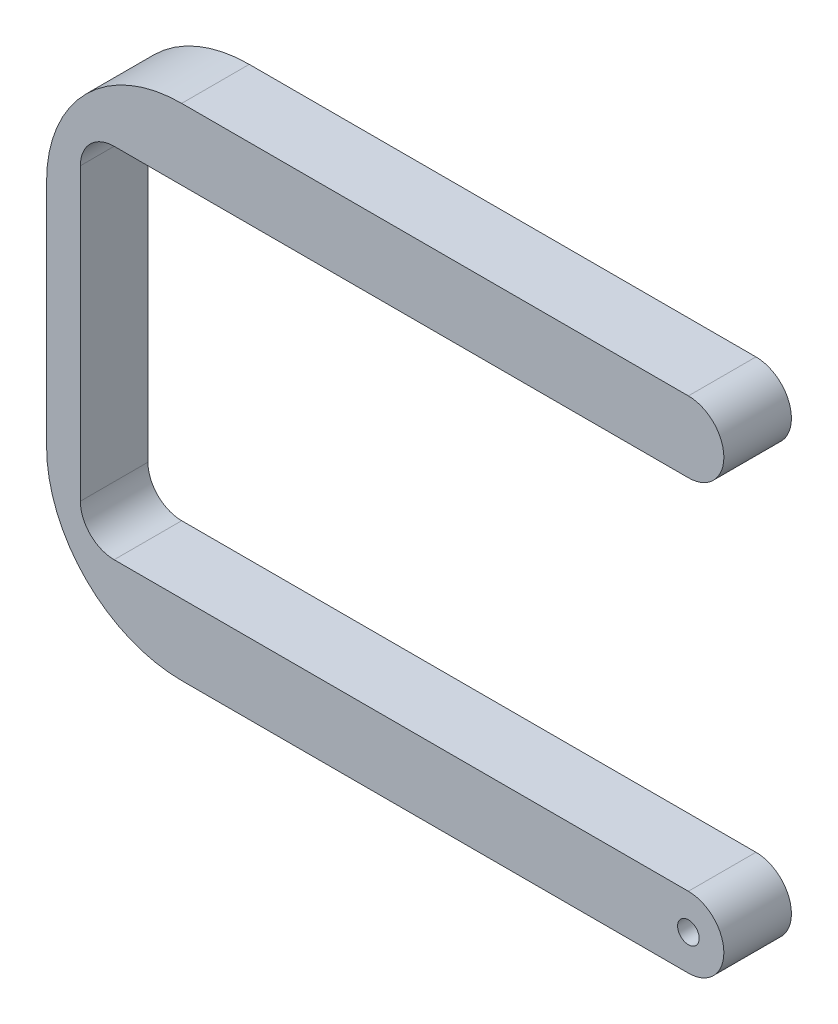
ISO-10303-21;
HEADER;
FILE_DESCRIPTION(('STEP AP214'),'2;1');
FILE_NAME('part.step','',(''),(''),'','','');
FILE_SCHEMA(('AUTOMOTIVE_DESIGN { 1 0 10303 214 1 1 1 1 }'));
ENDSEC;
DATA;
#1=APPLICATION_CONTEXT('core data for automotive mechanical design processes');
#2=APPLICATION_PROTOCOL_DEFINITION('international standard','automotive_design',2000,#1);
#3=PRODUCT_CONTEXT('',#1,'mechanical');
#4=PRODUCT('Part','Part','',(#3));
#5=PRODUCT_RELATED_PRODUCT_CATEGORY('part','',(#4));
#6=PRODUCT_DEFINITION_FORMATION('','',#4);
#7=PRODUCT_DEFINITION_CONTEXT('part definition',#1,'design');
#8=PRODUCT_DEFINITION('design','',#6,#7);
#9=PRODUCT_DEFINITION_SHAPE('','',#8);
#10=(LENGTH_UNIT() NAMED_UNIT(*) SI_UNIT(.MILLI.,.METRE.));
#11=(NAMED_UNIT(*) PLANE_ANGLE_UNIT() SI_UNIT($,.RADIAN.));
#12=(NAMED_UNIT(*) SI_UNIT($,.STERADIAN.) SOLID_ANGLE_UNIT());
#13=UNCERTAINTY_MEASURE_WITH_UNIT(LENGTH_MEASURE(1.E-05),#10,'distance_accuracy_value','');
#14=(GEOMETRIC_REPRESENTATION_CONTEXT(3) GLOBAL_UNCERTAINTY_ASSIGNED_CONTEXT((#13)) GLOBAL_UNIT_ASSIGNED_CONTEXT((#10,
#11,#12)) REPRESENTATION_CONTEXT('',''));
#15=CARTESIAN_POINT('',(0.,0.,0.));
#16=DIRECTION('',(0.,0.,1.));
#17=DIRECTION('',(1.,0.,0.));
#18=AXIS2_PLACEMENT_3D('',#15,#16,#17);
#19=CARTESIAN_POINT('',(-143.092977135482,0.,10.));
#20=DIRECTION('',(1.,0.,0.));
#21=DIRECTION('',(0.,0.,-1.));
#22=AXIS2_PLACEMENT_3D('',#19,#20,#21);
#23=PLANE('',#22);
#24=DIRECTION('',(0.,-1.,0.));
#25=VECTOR('',#24,1.);
#26=CARTESIAN_POINT('',(-143.092977135482,0.,0.));
#27=LINE('',#26,#25);
#28=CARTESIAN_POINT('',(-143.092977135482,-153.645932850951,0.));
#29=VERTEX_POINT('',#28);
#30=CARTESIAN_POINT('',(-143.092977135482,-187.645932850951,0.));
#31=VERTEX_POINT('',#30);
#32=EDGE_CURVE('E158',#29,#31,#27,.T.);
#33=ORIENTED_EDGE('',*,*,#32,.T.);
#34=DIRECTION('',(0.,0.,-1.));
#35=VECTOR('',#34,1.);
#36=CARTESIAN_POINT('',(-143.092977135482,-187.645932850951,10.));
#37=LINE('',#36,#35);
#38=CARTESIAN_POINT('',(-143.092977135482,-187.645932850951,10.));
#39=VERTEX_POINT('',#38);
#40=EDGE_CURVE('E11',#39,#31,#37,.T.);
#41=ORIENTED_EDGE('',*,*,#40,.F.);
#42=DIRECTION('',(0.,-1.,0.));
#43=VECTOR('',#42,1.);
#44=CARTESIAN_POINT('',(-143.092977135482,0.,10.));
#45=LINE('',#44,#43);
#46=CARTESIAN_POINT('',(-143.092977135482,-153.645932850951,10.));
#47=VERTEX_POINT('',#46);
#48=EDGE_CURVE('E188',#47,#39,#45,.T.);
#49=ORIENTED_EDGE('',*,*,#48,.F.);
#50=DIRECTION('',(0.,0.,-1.));
#51=VECTOR('',#50,1.);
#52=CARTESIAN_POINT('',(-143.092977135482,-153.645932850951,10.));
#53=LINE('',#52,#51);
#54=EDGE_CURVE('E157',#47,#29,#53,.T.);
#55=ORIENTED_EDGE('',*,*,#54,.T.);
#56=EDGE_LOOP('',(#33,#41,#49,#55));
#57=FACE_BOUND('',#56,.T.);
#58=ADVANCED_FACE('F36',(#57),#23,.F.);
#59=CARTESIAN_POINT('',(-123.092977135482,-187.645932850951,10.));
#60=DIRECTION('',(0.,0.,-1.));
#61=DIRECTION('',(-1.,0.,0.));
#62=AXIS2_PLACEMENT_3D('',#59,#60,#61);
#63=CYLINDRICAL_SURFACE('',#62,20.);
#64=CARTESIAN_POINT('',(-123.092977135482,-187.645932850951,0.));
#65=DIRECTION('',(0.,0.,1.));
#66=DIRECTION('',(1.,0.,0.));
#67=AXIS2_PLACEMENT_3D('',#64,#65,#66);
#68=CIRCLE('',#67,20.);
#69=CARTESIAN_POINT('',(-123.092977135481,-207.645932850951,0.));
#70=VERTEX_POINT('',#69);
#71=EDGE_CURVE('E161',#31,#70,#68,.T.);
#72=ORIENTED_EDGE('',*,*,#71,.T.);
#73=DIRECTION('',(0.,0.,-1.));
#74=VECTOR('',#73,1.);
#75=CARTESIAN_POINT('',(-123.092977135481,-207.645932850951,10.));
#76=LINE('',#75,#74);
#77=CARTESIAN_POINT('',(-123.092977135481,-207.645932850951,10.));
#78=VERTEX_POINT('',#77);
#79=EDGE_CURVE('E44',#78,#70,#76,.T.);
#80=ORIENTED_EDGE('',*,*,#79,.F.);
#81=CARTESIAN_POINT('',(-123.092977135482,-187.645932850951,10.));
#82=DIRECTION('',(0.,0.,1.));
#83=DIRECTION('',(1.,0.,0.));
#84=AXIS2_PLACEMENT_3D('',#81,#82,#83);
#85=CIRCLE('',#84,20.);
#86=EDGE_CURVE('E106',#39,#78,#85,.T.);
#87=ORIENTED_EDGE('',*,*,#86,.F.);
#88=ORIENTED_EDGE('',*,*,#40,.T.);
#89=EDGE_LOOP('',(#72,#80,#87,#88));
#90=FACE_BOUND('',#89,.T.);
#91=ADVANCED_FACE('F258',(#90),#63,.T.);
#92=CARTESIAN_POINT('',(0.,-207.645932850951,10.));
#93=DIRECTION('',(0.,1.,0.));
#94=DIRECTION('',(0.,0.,1.));
#95=AXIS2_PLACEMENT_3D('',#92,#93,#94);
#96=PLANE('',#95);
#97=DIRECTION('',(1.,0.,0.));
#98=VECTOR('',#97,1.);
#99=CARTESIAN_POINT('',(0.,-207.645932850951,0.));
#100=LINE('',#99,#98);
#101=CARTESIAN_POINT('',(-48.0929771354812,-207.645932850951,0.));
#102=VERTEX_POINT('',#101);
#103=EDGE_CURVE('E164',#70,#102,#100,.T.);
#104=ORIENTED_EDGE('',*,*,#103,.T.);
#105=DIRECTION('',(0.,0.,-1.));
#106=VECTOR('',#105,1.);
#107=CARTESIAN_POINT('',(-48.0929771354812,-207.645932850951,10.));
#108=LINE('',#107,#106);
#109=CARTESIAN_POINT('',(-48.0929771354812,-207.645932850951,10.));
#110=VERTEX_POINT('',#109);
#111=EDGE_CURVE('E202',#110,#102,#108,.T.);
#112=ORIENTED_EDGE('',*,*,#111,.F.);
#113=DIRECTION('',(1.,0.,0.));
#114=VECTOR('',#113,1.);
#115=CARTESIAN_POINT('',(0.,-207.645932850951,10.));
#116=LINE('',#115,#114);
#117=EDGE_CURVE('E209',#78,#110,#116,.T.);
#118=ORIENTED_EDGE('',*,*,#117,.F.);
#119=ORIENTED_EDGE('',*,*,#79,.T.);
#120=EDGE_LOOP('',(#104,#112,#118,#119));
#121=FACE_BOUND('',#120,.T.);
#122=ADVANCED_FACE('F207',(#121),#96,.F.);
#123=CARTESIAN_POINT('',(-48.0929771354814,-202.395932850951,10.));
#124=DIRECTION('',(0.,0.,-1.));
#125=DIRECTION('',(-1.,0.,0.));
#126=AXIS2_PLACEMENT_3D('',#123,#124,#125);
#127=CYLINDRICAL_SURFACE('',#126,5.25);
#128=CARTESIAN_POINT('',(-48.0929771354814,-202.395932850951,0.));
#129=DIRECTION('',(0.,0.,1.));
#130=DIRECTION('',(1.,0.,0.));
#131=AXIS2_PLACEMENT_3D('',#128,#129,#130);
#132=CIRCLE('',#131,5.25);
#133=CARTESIAN_POINT('',(-48.0929771354816,-197.145932850951,0.));
#134=VERTEX_POINT('',#133);
#135=EDGE_CURVE('E167',#134,#102,#132,.F.);
#136=ORIENTED_EDGE('',*,*,#135,.F.);
#137=DIRECTION('',(0.,0.,-1.));
#138=VECTOR('',#137,1.);
#139=CARTESIAN_POINT('',(-48.0929771354816,-197.145932850951,10.));
#140=LINE('',#139,#138);
#141=CARTESIAN_POINT('',(-48.0929771354816,-197.145932850951,10.));
#142=VERTEX_POINT('',#141);
#143=EDGE_CURVE('E200',#142,#134,#140,.T.);
#144=ORIENTED_EDGE('',*,*,#143,.F.);
#145=CARTESIAN_POINT('',(-48.0929771354814,-202.395932850951,10.));
#146=DIRECTION('',(0.,0.,1.));
#147=DIRECTION('',(1.,0.,0.));
#148=AXIS2_PLACEMENT_3D('',#145,#146,#147);
#149=CIRCLE('',#148,5.25);
#150=EDGE_CURVE('E219',#142,#110,#149,.F.);
#151=ORIENTED_EDGE('',*,*,#150,.T.);
#152=ORIENTED_EDGE('',*,*,#111,.T.);
#153=EDGE_LOOP('',(#136,#144,#151,#152));
#154=FACE_BOUND('',#153,.T.);
#155=ADVANCED_FACE('F216',(#154),#127,.T.);
#156=CARTESIAN_POINT('',(0.,-197.145932850951,10.));
#157=DIRECTION('',(0.,1.,0.));
#158=DIRECTION('',(0.,0.,1.));
#159=AXIS2_PLACEMENT_3D('',#156,#157,#158);
#160=PLANE('',#159);
#161=DIRECTION('',(1.,0.,0.));
#162=VECTOR('',#161,1.);
#163=CARTESIAN_POINT('',(0.,-197.145932850951,0.));
#164=LINE('',#163,#162);
#165=CARTESIAN_POINT('',(-133.092977135482,-197.145932850951,0.));
#166=VERTEX_POINT('',#165);
#167=EDGE_CURVE('E170',#166,#134,#164,.T.);
#168=ORIENTED_EDGE('',*,*,#167,.F.);
#169=DIRECTION('',(0.,0.,-1.));
#170=VECTOR('',#169,1.);
#171=CARTESIAN_POINT('',(-133.092977135482,-197.145932850951,10.));
#172=LINE('',#171,#170);
#173=CARTESIAN_POINT('',(-133.092977135482,-197.145932850951,10.));
#174=VERTEX_POINT('',#173);
#175=EDGE_CURVE('E198',#174,#166,#172,.T.);
#176=ORIENTED_EDGE('',*,*,#175,.F.);
#177=DIRECTION('',(1.,0.,0.));
#178=VECTOR('',#177,1.);
#179=CARTESIAN_POINT('',(0.,-197.145932850951,10.));
#180=LINE('',#179,#178);
#181=EDGE_CURVE('E222',#174,#142,#180,.T.);
#182=ORIENTED_EDGE('',*,*,#181,.T.);
#183=ORIENTED_EDGE('',*,*,#143,.T.);
#184=EDGE_LOOP('',(#168,#176,#182,#183));
#185=FACE_BOUND('',#184,.T.);
#186=ADVANCED_FACE('F269',(#185),#160,.T.);
#187=CARTESIAN_POINT('',(-133.092977135482,-192.145932850951,10.));
#188=DIRECTION('',(0.,0.,-1.));
#189=DIRECTION('',(-1.,0.,0.));
#190=AXIS2_PLACEMENT_3D('',#187,#188,#189);
#191=CYLINDRICAL_SURFACE('',#190,5.);
#192=CARTESIAN_POINT('',(-133.092977135482,-192.145932850951,0.));
#193=DIRECTION('',(0.,0.,1.));
#194=DIRECTION('',(1.,0.,0.));
#195=AXIS2_PLACEMENT_3D('',#192,#193,#194);
#196=CIRCLE('',#195,5.);
#197=CARTESIAN_POINT('',(-138.092977135482,-192.145932850951,0.));
#198=VERTEX_POINT('',#197);
#199=EDGE_CURVE('E173',#198,#166,#196,.T.);
#200=ORIENTED_EDGE('',*,*,#199,.F.);
#201=DIRECTION('',(0.,0.,-1.));
#202=VECTOR('',#201,1.);
#203=CARTESIAN_POINT('',(-138.092977135482,-192.145932850951,10.));
#204=LINE('',#203,#202);
#205=CARTESIAN_POINT('',(-138.092977135482,-192.145932850951,10.));
#206=VERTEX_POINT('',#205);
#207=EDGE_CURVE('E196',#206,#198,#204,.T.);
#208=ORIENTED_EDGE('',*,*,#207,.F.);
#209=CARTESIAN_POINT('',(-133.092977135482,-192.145932850951,10.));
#210=DIRECTION('',(0.,0.,1.));
#211=DIRECTION('',(1.,0.,0.));
#212=AXIS2_PLACEMENT_3D('',#209,#210,#211);
#213=CIRCLE('',#212,5.);
#214=EDGE_CURVE('E224',#206,#174,#213,.T.);
#215=ORIENTED_EDGE('',*,*,#214,.T.);
#216=ORIENTED_EDGE('',*,*,#175,.T.);
#217=EDGE_LOOP('',(#200,#208,#215,#216));
#218=FACE_BOUND('',#217,.T.);
#219=ADVANCED_FACE('F272',(#218),#191,.F.);
#220=CARTESIAN_POINT('',(-138.092977135482,0.,10.));
#221=DIRECTION('',(1.,0.,0.));
#222=DIRECTION('',(0.,0.,-1.));
#223=AXIS2_PLACEMENT_3D('',#220,#221,#222);
#224=PLANE('',#223);
#225=DIRECTION('',(0.,-1.,0.));
#226=VECTOR('',#225,1.);
#227=CARTESIAN_POINT('',(-138.092977135482,0.,0.));
#228=LINE('',#227,#226);
#229=CARTESIAN_POINT('',(-138.092977135482,-149.145932850951,0.));
#230=VERTEX_POINT('',#229);
#231=EDGE_CURVE('E176',#230,#198,#228,.T.);
#232=ORIENTED_EDGE('',*,*,#231,.F.);
#233=DIRECTION('',(0.,0.,-1.));
#234=VECTOR('',#233,1.);
#235=CARTESIAN_POINT('',(-138.092977135482,-149.145932850951,10.));
#236=LINE('',#235,#234);
#237=CARTESIAN_POINT('',(-138.092977135482,-149.145932850951,10.));
#238=VERTEX_POINT('',#237);
#239=EDGE_CURVE('E194',#238,#230,#236,.T.);
#240=ORIENTED_EDGE('',*,*,#239,.F.);
#241=DIRECTION('',(0.,-1.,0.));
#242=VECTOR('',#241,1.);
#243=CARTESIAN_POINT('',(-138.092977135482,0.,10.));
#244=LINE('',#243,#242);
#245=EDGE_CURVE('E231',#238,#206,#244,.T.);
#246=ORIENTED_EDGE('',*,*,#245,.T.);
#247=ORIENTED_EDGE('',*,*,#207,.T.);
#248=EDGE_LOOP('',(#232,#240,#246,#247));
#249=FACE_BOUND('',#248,.T.);
#250=ADVANCED_FACE('F276',(#249),#224,.T.);
#251=CARTESIAN_POINT('',(-133.092977135482,-149.145932850951,10.));
#252=DIRECTION('',(0.,0.,-1.));
#253=DIRECTION('',(-1.,0.,0.));
#254=AXIS2_PLACEMENT_3D('',#251,#252,#253);
#255=CYLINDRICAL_SURFACE('',#254,5.);
#256=CARTESIAN_POINT('',(-133.092977135482,-149.145932850951,0.));
#257=DIRECTION('',(0.,0.,1.));
#258=DIRECTION('',(1.,0.,0.));
#259=AXIS2_PLACEMENT_3D('',#256,#257,#258);
#260=CIRCLE('',#259,5.);
#261=CARTESIAN_POINT('',(-133.092977135482,-144.145932850951,0.));
#262=VERTEX_POINT('',#261);
#263=EDGE_CURVE('E179',#262,#230,#260,.T.);
#264=ORIENTED_EDGE('',*,*,#263,.F.);
#265=DIRECTION('',(0.,0.,-1.));
#266=VECTOR('',#265,1.);
#267=CARTESIAN_POINT('',(-133.092977135482,-144.145932850951,10.));
#268=LINE('',#267,#266);
#269=CARTESIAN_POINT('',(-133.092977135482,-144.145932850951,10.));
#270=VERTEX_POINT('',#269);
#271=EDGE_CURVE('E192',#270,#262,#268,.T.);
#272=ORIENTED_EDGE('',*,*,#271,.F.);
#273=CARTESIAN_POINT('',(-133.092977135482,-149.145932850951,10.));
#274=DIRECTION('',(0.,0.,1.));
#275=DIRECTION('',(1.,0.,0.));
#276=AXIS2_PLACEMENT_3D('',#273,#274,#275);
#277=CIRCLE('',#276,5.);
#278=EDGE_CURVE('E152',#270,#238,#277,.T.);
#279=ORIENTED_EDGE('',*,*,#278,.T.);
#280=ORIENTED_EDGE('',*,*,#239,.T.);
#281=EDGE_LOOP('',(#264,#272,#279,#280));
#282=FACE_BOUND('',#281,.T.);
#283=ADVANCED_FACE('F236',(#282),#255,.F.);
#284=CARTESIAN_POINT('',(0.,-144.145932850951,10.));
#285=DIRECTION('',(0.,-1.,0.));
#286=DIRECTION('',(0.,0.,-1.));
#287=AXIS2_PLACEMENT_3D('',#284,#285,#286);
#288=PLANE('',#287);
#289=DIRECTION('',(-1.,0.,0.));
#290=VECTOR('',#289,1.);
#291=CARTESIAN_POINT('',(0.,-144.145932850951,0.));
#292=LINE('',#291,#290);
#293=CARTESIAN_POINT('',(-48.0929771354816,-144.145932850951,0.));
#294=VERTEX_POINT('',#293);
#295=EDGE_CURVE('E182',#294,#262,#292,.T.);
#296=ORIENTED_EDGE('',*,*,#295,.F.);
#297=DIRECTION('',(0.,0.,-1.));
#298=VECTOR('',#297,1.);
#299=CARTESIAN_POINT('',(-48.0929771354816,-144.145932850951,10.));
#300=LINE('',#299,#298);
#301=CARTESIAN_POINT('',(-48.0929771354816,-144.145932850951,10.));
#302=VERTEX_POINT('',#301);
#303=EDGE_CURVE('E140',#302,#294,#300,.T.);
#304=ORIENTED_EDGE('',*,*,#303,.F.);
#305=DIRECTION('',(-1.,0.,0.));
#306=VECTOR('',#305,1.);
#307=CARTESIAN_POINT('',(0.,-144.145932850951,10.));
#308=LINE('',#307,#306);
#309=EDGE_CURVE('E150',#302,#270,#308,.T.);
#310=ORIENTED_EDGE('',*,*,#309,.T.);
#311=ORIENTED_EDGE('',*,*,#271,.T.);
#312=EDGE_LOOP('',(#296,#304,#310,#311));
#313=FACE_BOUND('',#312,.T.);
#314=ADVANCED_FACE('F242',(#313),#288,.T.);
#315=CARTESIAN_POINT('',(-48.0929771354814,-138.895932850951,10.));
#316=DIRECTION('',(0.,0.,-1.));
#317=DIRECTION('',(-1.,0.,0.));
#318=AXIS2_PLACEMENT_3D('',#315,#316,#317);
#319=CYLINDRICAL_SURFACE('',#318,5.25);
#320=CARTESIAN_POINT('',(-48.0929771354814,-138.895932850951,0.));
#321=DIRECTION('',(0.,0.,1.));
#322=DIRECTION('',(1.,0.,0.));
#323=AXIS2_PLACEMENT_3D('',#320,#321,#322);
#324=CIRCLE('',#323,5.25);
#325=CARTESIAN_POINT('',(-48.0929771354812,-133.645932850951,0.));
#326=VERTEX_POINT('',#325);
#327=EDGE_CURVE('E139',#326,#294,#324,.F.);
#328=ORIENTED_EDGE('',*,*,#327,.F.);
#329=DIRECTION('',(0.,0.,-1.));
#330=VECTOR('',#329,1.);
#331=CARTESIAN_POINT('',(-48.0929771354812,-133.645932850951,10.));
#332=LINE('',#331,#330);
#333=CARTESIAN_POINT('',(-48.0929771354812,-133.645932850951,10.));
#334=VERTEX_POINT('',#333);
#335=EDGE_CURVE('E133',#334,#326,#332,.T.);
#336=ORIENTED_EDGE('',*,*,#335,.F.);
#337=CARTESIAN_POINT('',(-48.0929771354814,-138.895932850951,10.));
#338=DIRECTION('',(0.,0.,1.));
#339=DIRECTION('',(1.,0.,0.));
#340=AXIS2_PLACEMENT_3D('',#337,#338,#339);
#341=CIRCLE('',#340,5.25);
#342=EDGE_CURVE('E137',#334,#302,#341,.F.);
#343=ORIENTED_EDGE('',*,*,#342,.T.);
#344=ORIENTED_EDGE('',*,*,#303,.T.);
#345=EDGE_LOOP('',(#328,#336,#343,#344));
#346=FACE_BOUND('',#345,.T.);
#347=ADVANCED_FACE('F135',(#346),#319,.T.);
#348=CARTESIAN_POINT('',(0.,-133.645932850951,10.));
#349=DIRECTION('',(0.,-1.,0.));
#350=DIRECTION('',(0.,0.,-1.));
#351=AXIS2_PLACEMENT_3D('',#348,#349,#350);
#352=PLANE('',#351);
#353=DIRECTION('',(-1.,0.,0.));
#354=VECTOR('',#353,1.);
#355=CARTESIAN_POINT('',(0.,-133.645932850951,0.));
#356=LINE('',#355,#354);
#357=CARTESIAN_POINT('',(-123.092977135481,-133.645932850951,0.));
#358=VERTEX_POINT('',#357);
#359=EDGE_CURVE('E92',#326,#358,#356,.T.);
#360=ORIENTED_EDGE('',*,*,#359,.T.);
#361=DIRECTION('',(0.,0.,-1.));
#362=VECTOR('',#361,1.);
#363=CARTESIAN_POINT('',(-123.092977135481,-133.645932850951,10.));
#364=LINE('',#363,#362);
#365=CARTESIAN_POINT('',(-123.092977135481,-133.645932850951,10.));
#366=VERTEX_POINT('',#365);
#367=EDGE_CURVE('E141',#366,#358,#364,.T.);
#368=ORIENTED_EDGE('',*,*,#367,.F.);
#369=DIRECTION('',(-1.,0.,0.));
#370=VECTOR('',#369,1.);
#371=CARTESIAN_POINT('',(0.,-133.645932850951,10.));
#372=LINE('',#371,#370);
#373=EDGE_CURVE('E143',#334,#366,#372,.T.);
#374=ORIENTED_EDGE('',*,*,#373,.F.);
#375=ORIENTED_EDGE('',*,*,#335,.T.);
#376=EDGE_LOOP('',(#360,#368,#374,#375));
#377=FACE_BOUND('',#376,.T.);
#378=ADVANCED_FACE('F144',(#377),#352,.F.);
#379=CARTESIAN_POINT('',(-123.092977135482,-153.645932850951,10.));
#380=DIRECTION('',(0.,0.,-1.));
#381=DIRECTION('',(-1.,0.,0.));
#382=AXIS2_PLACEMENT_3D('',#379,#380,#381);
#383=CYLINDRICAL_SURFACE('',#382,20.);
#384=CARTESIAN_POINT('',(-123.092977135482,-153.645932850951,0.));
#385=DIRECTION('',(0.,0.,1.));
#386=DIRECTION('',(1.,0.,0.));
#387=AXIS2_PLACEMENT_3D('',#384,#385,#386);
#388=CIRCLE('',#387,20.);
#389=EDGE_CURVE('E98',#358,#29,#388,.T.);
#390=ORIENTED_EDGE('',*,*,#389,.T.);
#391=ORIENTED_EDGE('',*,*,#54,.F.);
#392=CARTESIAN_POINT('',(-123.092977135482,-153.645932850951,10.));
#393=DIRECTION('',(0.,0.,1.));
#394=DIRECTION('',(1.,0.,0.));
#395=AXIS2_PLACEMENT_3D('',#392,#393,#394);
#396=CIRCLE('',#395,20.);
#397=EDGE_CURVE('E52',#366,#47,#396,.T.);
#398=ORIENTED_EDGE('',*,*,#397,.F.);
#399=ORIENTED_EDGE('',*,*,#367,.T.);
#400=EDGE_LOOP('',(#390,#391,#398,#399));
#401=FACE_BOUND('',#400,.T.);
#402=ADVANCED_FACE('F246',(#401),#383,.T.);
#403=CARTESIAN_POINT('',(0.,0.,10.));
#404=DIRECTION('',(0.,0.,1.));
#405=DIRECTION('',(1.,0.,0.));
#406=AXIS2_PLACEMENT_3D('',#403,#404,#405);
#407=PLANE('',#406);
#408=CARTESIAN_POINT('',(-48.0929771354814,-202.395935058414,10.));
#409=DIRECTION('',(0.,0.,1.));
#410=DIRECTION('',(1.,0.,0.));
#411=AXIS2_PLACEMENT_3D('',#408,#409,#410);
#412=CIRCLE('',#411,1.6);
#413=CARTESIAN_POINT('',(-46.4929771354814,-202.395935058414,10.));
#414=VERTEX_POINT('',#413);
#415=EDGE_CURVE('E331',#414,#414,#412,.T.);
#416=ORIENTED_EDGE('',*,*,#415,.F.);
#417=EDGE_LOOP('',(#416));
#418=FACE_BOUND('',#417,.T.);
#419=ORIENTED_EDGE('',*,*,#48,.T.);
#420=ORIENTED_EDGE('',*,*,#86,.T.);
#421=ORIENTED_EDGE('',*,*,#117,.T.);
#422=ORIENTED_EDGE('',*,*,#150,.F.);
#423=ORIENTED_EDGE('',*,*,#181,.F.);
#424=ORIENTED_EDGE('',*,*,#214,.F.);
#425=ORIENTED_EDGE('',*,*,#245,.F.);
#426=ORIENTED_EDGE('',*,*,#278,.F.);
#427=ORIENTED_EDGE('',*,*,#309,.F.);
#428=ORIENTED_EDGE('',*,*,#342,.F.);
#429=ORIENTED_EDGE('',*,*,#373,.T.);
#430=ORIENTED_EDGE('',*,*,#397,.T.);
#431=EDGE_LOOP('',(#419,#420,#421,#422,#423,#424,#425,#426,#427,#428,#429,#430));
#432=FACE_BOUND('',#431,.T.);
#433=ADVANCED_FACE('F147',(#418,#432),#407,.T.);
#434=CARTESIAN_POINT('',(0.,0.,0.));
#435=DIRECTION('',(0.,0.,1.));
#436=DIRECTION('',(1.,0.,0.));
#437=AXIS2_PLACEMENT_3D('',#434,#435,#436);
#438=PLANE('',#437);
#439=CARTESIAN_POINT('',(-48.0929771354814,-202.395935058414,0.));
#440=DIRECTION('',(0.,0.,1.));
#441=DIRECTION('',(1.,0.,0.));
#442=AXIS2_PLACEMENT_3D('',#439,#440,#441);
#443=CIRCLE('',#442,1.6);
#444=CARTESIAN_POINT('',(-46.4929771354814,-202.395935058414,0.));
#445=VERTEX_POINT('',#444);
#446=EDGE_CURVE('E162',#445,#445,#443,.T.);
#447=ORIENTED_EDGE('',*,*,#446,.T.);
#448=EDGE_LOOP('',(#447));
#449=FACE_BOUND('',#448,.T.);
#450=ORIENTED_EDGE('',*,*,#32,.F.);
#451=ORIENTED_EDGE('',*,*,#389,.F.);
#452=ORIENTED_EDGE('',*,*,#359,.F.);
#453=ORIENTED_EDGE('',*,*,#327,.T.);
#454=ORIENTED_EDGE('',*,*,#295,.T.);
#455=ORIENTED_EDGE('',*,*,#263,.T.);
#456=ORIENTED_EDGE('',*,*,#231,.T.);
#457=ORIENTED_EDGE('',*,*,#199,.T.);
#458=ORIENTED_EDGE('',*,*,#167,.T.);
#459=ORIENTED_EDGE('',*,*,#135,.T.);
#460=ORIENTED_EDGE('',*,*,#103,.F.);
#461=ORIENTED_EDGE('',*,*,#71,.F.);
#462=EDGE_LOOP('',(#450,#451,#452,#453,#454,#455,#456,#457,#458,#459,#460,#461));
#463=FACE_BOUND('',#462,.T.);
#464=ADVANCED_FACE('F212',(#449,#463),#438,.F.);
#465=CARTESIAN_POINT('',(-48.0929771354814,-202.395935058414,0.));
#466=DIRECTION('',(0.,0.,1.));
#467=DIRECTION('',(1.,0.,0.));
#468=AXIS2_PLACEMENT_3D('',#465,#466,#467);
#469=CYLINDRICAL_SURFACE('',#468,1.6);
#470=ORIENTED_EDGE('',*,*,#446,.F.);
#471=EDGE_LOOP('',(#470));
#472=FACE_BOUND('',#471,.T.);
#473=ORIENTED_EDGE('',*,*,#415,.T.);
#474=EDGE_LOOP('',(#473));
#475=FACE_BOUND('',#474,.T.);
#476=ADVANCED_FACE('F313',(#472,#475),#469,.F.);
#477=CLOSED_SHELL('',(#58,#91,#122,#155,#186,#219,#250,#283,#314,#347,#378,#402,#433,#464,#476));
#478=MANIFOLD_SOLID_BREP('B2',#477);
#479=ADVANCED_BREP_SHAPE_REPRESENTATION('',(#18,#478),#14);
#480=SHAPE_DEFINITION_REPRESENTATION(#9,#479);
ENDSEC;
END-ISO-10303-21;
